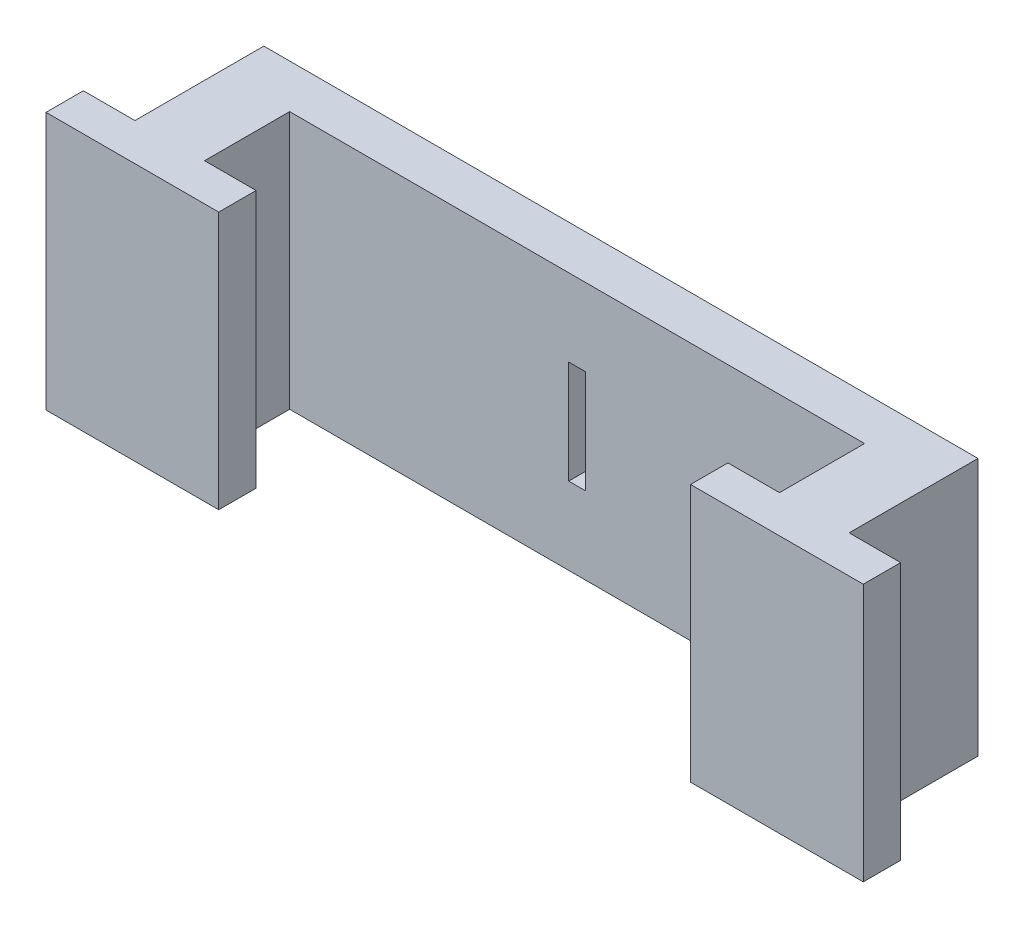
ISO-10303-21;
HEADER;
FILE_DESCRIPTION(('STEP AP214'),'2;1');
FILE_NAME('part.step','',(''),(''),'','','');
FILE_SCHEMA(('AUTOMOTIVE_DESIGN { 1 0 10303 214 1 1 1 1 }'));
ENDSEC;
DATA;
#1=APPLICATION_CONTEXT('core data for automotive mechanical design processes');
#2=APPLICATION_PROTOCOL_DEFINITION('international standard','automotive_design',2000,#1);
#3=PRODUCT_CONTEXT('',#1,'mechanical');
#4=PRODUCT('Part','Part','',(#3));
#5=PRODUCT_RELATED_PRODUCT_CATEGORY('part','',(#4));
#6=PRODUCT_DEFINITION_FORMATION('','',#4);
#7=PRODUCT_DEFINITION_CONTEXT('part definition',#1,'design');
#8=PRODUCT_DEFINITION('design','',#6,#7);
#9=PRODUCT_DEFINITION_SHAPE('','',#8);
#10=(LENGTH_UNIT() NAMED_UNIT(*) SI_UNIT(.MILLI.,.METRE.));
#11=(NAMED_UNIT(*) PLANE_ANGLE_UNIT() SI_UNIT($,.RADIAN.));
#12=(NAMED_UNIT(*) SI_UNIT($,.STERADIAN.) SOLID_ANGLE_UNIT());
#13=UNCERTAINTY_MEASURE_WITH_UNIT(LENGTH_MEASURE(1.E-05),#10,'distance_accuracy_value','');
#14=(GEOMETRIC_REPRESENTATION_CONTEXT(3) GLOBAL_UNCERTAINTY_ASSIGNED_CONTEXT((#13)) GLOBAL_UNIT_ASSIGNED_CONTEXT((#10,
#11,#12)) REPRESENTATION_CONTEXT('',''));
#15=CARTESIAN_POINT('',(0.,0.,0.));
#16=DIRECTION('',(0.,0.,1.));
#17=DIRECTION('',(1.,0.,0.));
#18=AXIS2_PLACEMENT_3D('',#15,#16,#17);
#19=CARTESIAN_POINT('',(0.,0.,0.));
#20=DIRECTION('',(0.,1.,0.));
#21=DIRECTION('',(0.,0.,1.));
#22=AXIS2_PLACEMENT_3D('',#19,#20,#21);
#23=PLANE('',#22);
#24=DIRECTION('',(-1.,0.,0.));
#25=VECTOR('',#24,1.);
#26=CARTESIAN_POINT('',(-1.35,0.,-1.6));
#27=LINE('',#26,#25);
#28=CARTESIAN_POINT('',(-1.35,0.,-1.6));
#29=VERTEX_POINT('',#28);
#30=CARTESIAN_POINT('',(-3.35,0.,-1.6));
#31=VERTEX_POINT('',#30);
#32=EDGE_CURVE('E197',#29,#31,#27,.T.);
#33=ORIENTED_EDGE('',*,*,#32,.F.);
#34=DIRECTION('',(0.,0.,1.));
#35=VECTOR('',#34,1.);
#36=CARTESIAN_POINT('',(-1.35,0.,-6.6));
#37=LINE('',#36,#35);
#38=CARTESIAN_POINT('',(-1.35,0.,-6.6));
#39=VERTEX_POINT('',#38);
#40=EDGE_CURVE('E242',#39,#29,#37,.T.);
#41=ORIENTED_EDGE('',*,*,#40,.F.);
#42=DIRECTION('',(-1.,0.,0.));
#43=VECTOR('',#42,1.);
#44=CARTESIAN_POINT('',(26.35,0.,-6.6));
#45=LINE('',#44,#43);
#46=CARTESIAN_POINT('',(26.35,0.,-6.6));
#47=VERTEX_POINT('',#46);
#48=EDGE_CURVE('E239',#47,#39,#45,.T.);
#49=ORIENTED_EDGE('',*,*,#48,.F.);
#50=DIRECTION('',(0.,0.,-1.));
#51=VECTOR('',#50,1.);
#52=CARTESIAN_POINT('',(26.35,0.,-1.6));
#53=LINE('',#52,#51);
#54=CARTESIAN_POINT('',(26.35,0.,-1.6));
#55=VERTEX_POINT('',#54);
#56=EDGE_CURVE('E236',#55,#47,#53,.T.);
#57=ORIENTED_EDGE('',*,*,#56,.F.);
#58=DIRECTION('',(-1.,0.,0.));
#59=VECTOR('',#58,1.);
#60=CARTESIAN_POINT('',(28.35,0.,-1.6));
#61=LINE('',#60,#59);
#62=CARTESIAN_POINT('',(28.35,0.,-1.6));
#63=VERTEX_POINT('',#62);
#64=EDGE_CURVE('E233',#63,#55,#61,.T.);
#65=ORIENTED_EDGE('',*,*,#64,.F.);
#66=DIRECTION('',(0.,0.,-1.));
#67=VECTOR('',#66,1.);
#68=CARTESIAN_POINT('',(28.35,0.,-0.15));
#69=LINE('',#68,#67);
#70=CARTESIAN_POINT('',(28.35,0.,-0.15));
#71=VERTEX_POINT('',#70);
#72=EDGE_CURVE('E230',#71,#63,#69,.T.);
#73=ORIENTED_EDGE('',*,*,#72,.F.);
#74=DIRECTION('',(1.,0.,0.));
#75=VECTOR('',#74,1.);
#76=CARTESIAN_POINT('',(21.65,0.,-0.15));
#77=LINE('',#76,#75);
#78=CARTESIAN_POINT('',(21.65,0.,-0.15));
#79=VERTEX_POINT('',#78);
#80=EDGE_CURVE('E227',#79,#71,#77,.T.);
#81=ORIENTED_EDGE('',*,*,#80,.F.);
#82=DIRECTION('',(0.,0.,1.));
#83=VECTOR('',#82,1.);
#84=CARTESIAN_POINT('',(21.65,0.,-1.6));
#85=LINE('',#84,#83);
#86=CARTESIAN_POINT('',(21.65,0.,-1.6));
#87=VERTEX_POINT('',#86);
#88=EDGE_CURVE('E224',#87,#79,#85,.T.);
#89=ORIENTED_EDGE('',*,*,#88,.F.);
#90=DIRECTION('',(-1.,0.,0.));
#91=VECTOR('',#90,1.);
#92=CARTESIAN_POINT('',(23.65,0.,-1.6));
#93=LINE('',#92,#91);
#94=CARTESIAN_POINT('',(23.65,0.,-1.6));
#95=VERTEX_POINT('',#94);
#96=EDGE_CURVE('E221',#95,#87,#93,.T.);
#97=ORIENTED_EDGE('',*,*,#96,.F.);
#98=DIRECTION('',(0.,0.,1.));
#99=VECTOR('',#98,1.);
#100=CARTESIAN_POINT('',(23.65,0.,-4.9));
#101=LINE('',#100,#99);
#102=CARTESIAN_POINT('',(23.65,0.,-4.9));
#103=VERTEX_POINT('',#102);
#104=EDGE_CURVE('E218',#103,#95,#101,.T.);
#105=ORIENTED_EDGE('',*,*,#104,.F.);
#106=DIRECTION('',(1.,0.,0.));
#107=VECTOR('',#106,1.);
#108=CARTESIAN_POINT('',(1.35,0.,-4.9));
#109=LINE('',#108,#107);
#110=CARTESIAN_POINT('',(1.35,0.,-4.9));
#111=VERTEX_POINT('',#110);
#112=EDGE_CURVE('E215',#111,#103,#109,.T.);
#113=ORIENTED_EDGE('',*,*,#112,.F.);
#114=DIRECTION('',(0.,0.,-1.));
#115=VECTOR('',#114,1.);
#116=CARTESIAN_POINT('',(1.35,0.,-1.6));
#117=LINE('',#116,#115);
#118=CARTESIAN_POINT('',(1.35,0.,-1.6));
#119=VERTEX_POINT('',#118);
#120=EDGE_CURVE('E212',#119,#111,#117,.T.);
#121=ORIENTED_EDGE('',*,*,#120,.F.);
#122=DIRECTION('',(-1.,0.,0.));
#123=VECTOR('',#122,1.);
#124=CARTESIAN_POINT('',(3.35,0.,-1.6));
#125=LINE('',#124,#123);
#126=CARTESIAN_POINT('',(3.35,0.,-1.6));
#127=VERTEX_POINT('',#126);
#128=EDGE_CURVE('E209',#127,#119,#125,.T.);
#129=ORIENTED_EDGE('',*,*,#128,.F.);
#130=DIRECTION('',(0.,0.,-1.));
#131=VECTOR('',#130,1.);
#132=CARTESIAN_POINT('',(3.35,0.,-0.15));
#133=LINE('',#132,#131);
#134=CARTESIAN_POINT('',(3.35,0.,-0.15));
#135=VERTEX_POINT('',#134);
#136=EDGE_CURVE('E206',#135,#127,#133,.T.);
#137=ORIENTED_EDGE('',*,*,#136,.F.);
#138=DIRECTION('',(1.,0.,0.));
#139=VECTOR('',#138,1.);
#140=CARTESIAN_POINT('',(-3.35,0.,-0.15));
#141=LINE('',#140,#139);
#142=CARTESIAN_POINT('',(-3.35,0.,-0.15));
#143=VERTEX_POINT('',#142);
#144=EDGE_CURVE('E203',#143,#135,#141,.T.);
#145=ORIENTED_EDGE('',*,*,#144,.F.);
#146=DIRECTION('',(0.,0.,1.));
#147=VECTOR('',#146,1.);
#148=CARTESIAN_POINT('',(-3.35,0.,-1.6));
#149=LINE('',#148,#147);
#150=EDGE_CURVE('E199',#31,#143,#149,.T.);
#151=ORIENTED_EDGE('',*,*,#150,.F.);
#152=EDGE_LOOP('',(#33,#41,#49,#57,#65,#73,#81,#89,#97,#105,#113,#121,#129,#137,#145,#151));
#153=FACE_BOUND('',#152,.T.);
#154=ADVANCED_FACE('F33',(#153),#23,.F.);
#155=CARTESIAN_POINT('',(-1.35,0.,-1.6));
#156=DIRECTION('',(0.,0.,-1.));
#157=DIRECTION('',(-1.,0.,0.));
#158=AXIS2_PLACEMENT_3D('',#155,#156,#157);
#159=PLANE('',#158);
#160=DIRECTION('',(-1.,0.,0.));
#161=VECTOR('',#160,1.);
#162=CARTESIAN_POINT('',(-1.35,10.,-1.6));
#163=LINE('',#162,#161);
#164=CARTESIAN_POINT('',(-1.35,10.,-1.6));
#165=VERTEX_POINT('',#164);
#166=CARTESIAN_POINT('',(-3.35,10.,-1.6));
#167=VERTEX_POINT('',#166);
#168=EDGE_CURVE('E194',#165,#167,#163,.T.);
#169=ORIENTED_EDGE('',*,*,#168,.F.);
#170=DIRECTION('',(0.,1.,0.));
#171=VECTOR('',#170,1.);
#172=CARTESIAN_POINT('',(-1.35,0.,-1.6));
#173=LINE('',#172,#171);
#174=EDGE_CURVE('E292',#29,#165,#173,.T.);
#175=ORIENTED_EDGE('',*,*,#174,.F.);
#176=ORIENTED_EDGE('',*,*,#32,.T.);
#177=DIRECTION('',(0.,1.,0.));
#178=VECTOR('',#177,1.);
#179=CARTESIAN_POINT('',(-3.35,0.,-1.6));
#180=LINE('',#179,#178);
#181=EDGE_CURVE('E245',#31,#167,#180,.T.);
#182=ORIENTED_EDGE('',*,*,#181,.T.);
#183=EDGE_LOOP('',(#169,#175,#176,#182));
#184=FACE_BOUND('',#183,.T.);
#185=ADVANCED_FACE('F348',(#184),#159,.T.);
#186=CARTESIAN_POINT('',(-1.35,0.,-6.6));
#187=DIRECTION('',(-1.,0.,0.));
#188=DIRECTION('',(0.,0.,1.));
#189=AXIS2_PLACEMENT_3D('',#186,#187,#188);
#190=PLANE('',#189);
#191=DIRECTION('',(0.,0.,1.));
#192=VECTOR('',#191,1.);
#193=CARTESIAN_POINT('',(-1.35,10.,-6.6));
#194=LINE('',#193,#192);
#195=CARTESIAN_POINT('',(-1.35,10.,-6.6));
#196=VERTEX_POINT('',#195);
#197=EDGE_CURVE('E200',#196,#165,#194,.T.);
#198=ORIENTED_EDGE('',*,*,#197,.F.);
#199=DIRECTION('',(0.,1.,0.));
#200=VECTOR('',#199,1.);
#201=CARTESIAN_POINT('',(-1.35,0.,-6.6));
#202=LINE('',#201,#200);
#203=EDGE_CURVE('E295',#39,#196,#202,.T.);
#204=ORIENTED_EDGE('',*,*,#203,.F.);
#205=ORIENTED_EDGE('',*,*,#40,.T.);
#206=ORIENTED_EDGE('',*,*,#174,.T.);
#207=EDGE_LOOP('',(#198,#204,#205,#206));
#208=FACE_BOUND('',#207,.T.);
#209=ADVANCED_FACE('F353',(#208),#190,.T.);
#210=CARTESIAN_POINT('',(26.35,0.,-6.6));
#211=DIRECTION('',(0.,0.,-1.));
#212=DIRECTION('',(-1.,0.,0.));
#213=AXIS2_PLACEMENT_3D('',#210,#211,#212);
#214=PLANE('',#213);
#215=DIRECTION('',(0.,1.,0.));
#216=VECTOR('',#215,1.);
#217=CARTESIAN_POINT('',(12.175,3.,-6.6));
#218=LINE('',#217,#216);
#219=CARTESIAN_POINT('',(12.175,3.,-6.6));
#220=VERTEX_POINT('',#219);
#221=CARTESIAN_POINT('',(12.175,7.,-6.6));
#222=VERTEX_POINT('',#221);
#223=EDGE_CURVE('E47',#220,#222,#218,.T.);
#224=ORIENTED_EDGE('',*,*,#223,.F.);
#225=DIRECTION('',(-1.,0.,0.));
#226=VECTOR('',#225,1.);
#227=CARTESIAN_POINT('',(12.175,3.,-6.6));
#228=LINE('',#227,#226);
#229=CARTESIAN_POINT('',(12.825,3.,-6.6));
#230=VERTEX_POINT('',#229);
#231=EDGE_CURVE('E187',#230,#220,#228,.T.);
#232=ORIENTED_EDGE('',*,*,#231,.F.);
#233=DIRECTION('',(0.,-1.,0.));
#234=VECTOR('',#233,1.);
#235=CARTESIAN_POINT('',(12.825,3.,-6.6));
#236=LINE('',#235,#234);
#237=CARTESIAN_POINT('',(12.825,7.,-6.6));
#238=VERTEX_POINT('',#237);
#239=EDGE_CURVE('E171',#238,#230,#236,.T.);
#240=ORIENTED_EDGE('',*,*,#239,.F.);
#241=DIRECTION('',(1.,0.,0.));
#242=VECTOR('',#241,1.);
#243=CARTESIAN_POINT('',(12.175,7.,-6.6));
#244=LINE('',#243,#242);
#245=EDGE_CURVE('E180',#222,#238,#244,.T.);
#246=ORIENTED_EDGE('',*,*,#245,.F.);
#247=EDGE_LOOP('',(#224,#232,#240,#246));
#248=FACE_BOUND('',#247,.T.);
#249=DIRECTION('',(-1.,0.,0.));
#250=VECTOR('',#249,1.);
#251=CARTESIAN_POINT('',(26.35,10.,-6.6));
#252=LINE('',#251,#250);
#253=CARTESIAN_POINT('',(26.35,10.,-6.6));
#254=VERTEX_POINT('',#253);
#255=EDGE_CURVE('E287',#254,#196,#252,.T.);
#256=ORIENTED_EDGE('',*,*,#255,.F.);
#257=DIRECTION('',(0.,1.,0.));
#258=VECTOR('',#257,1.);
#259=CARTESIAN_POINT('',(26.35,0.,-6.6));
#260=LINE('',#259,#258);
#261=EDGE_CURVE('E297',#47,#254,#260,.T.);
#262=ORIENTED_EDGE('',*,*,#261,.F.);
#263=ORIENTED_EDGE('',*,*,#48,.T.);
#264=ORIENTED_EDGE('',*,*,#203,.T.);
#265=EDGE_LOOP('',(#256,#262,#263,#264));
#266=FACE_BOUND('',#265,.T.);
#267=ADVANCED_FACE('F184',(#248,#266),#214,.T.);
#268=CARTESIAN_POINT('',(26.35,0.,-1.6));
#269=DIRECTION('',(1.,0.,0.));
#270=DIRECTION('',(0.,0.,-1.));
#271=AXIS2_PLACEMENT_3D('',#268,#269,#270);
#272=PLANE('',#271);
#273=DIRECTION('',(0.,0.,-1.));
#274=VECTOR('',#273,1.);
#275=CARTESIAN_POINT('',(26.35,10.,-1.6));
#276=LINE('',#275,#274);
#277=CARTESIAN_POINT('',(26.35,10.,-1.6));
#278=VERTEX_POINT('',#277);
#279=EDGE_CURVE('E284',#278,#254,#276,.T.);
#280=ORIENTED_EDGE('',*,*,#279,.F.);
#281=DIRECTION('',(0.,1.,0.));
#282=VECTOR('',#281,1.);
#283=CARTESIAN_POINT('',(26.35,0.,-1.6));
#284=LINE('',#283,#282);
#285=EDGE_CURVE('E299',#55,#278,#284,.T.);
#286=ORIENTED_EDGE('',*,*,#285,.F.);
#287=ORIENTED_EDGE('',*,*,#56,.T.);
#288=ORIENTED_EDGE('',*,*,#261,.T.);
#289=EDGE_LOOP('',(#280,#286,#287,#288));
#290=FACE_BOUND('',#289,.T.);
#291=ADVANCED_FACE('F373',(#290),#272,.T.);
#292=CARTESIAN_POINT('',(28.35,0.,-1.6));
#293=DIRECTION('',(0.,0.,-1.));
#294=DIRECTION('',(-1.,0.,0.));
#295=AXIS2_PLACEMENT_3D('',#292,#293,#294);
#296=PLANE('',#295);
#297=DIRECTION('',(-1.,0.,0.));
#298=VECTOR('',#297,1.);
#299=CARTESIAN_POINT('',(28.35,10.,-1.6));
#300=LINE('',#299,#298);
#301=CARTESIAN_POINT('',(28.35,10.,-1.6));
#302=VERTEX_POINT('',#301);
#303=EDGE_CURVE('E281',#302,#278,#300,.T.);
#304=ORIENTED_EDGE('',*,*,#303,.F.);
#305=DIRECTION('',(0.,1.,0.));
#306=VECTOR('',#305,1.);
#307=CARTESIAN_POINT('',(28.35,0.,-1.6));
#308=LINE('',#307,#306);
#309=EDGE_CURVE('E301',#63,#302,#308,.T.);
#310=ORIENTED_EDGE('',*,*,#309,.F.);
#311=ORIENTED_EDGE('',*,*,#64,.T.);
#312=ORIENTED_EDGE('',*,*,#285,.T.);
#313=EDGE_LOOP('',(#304,#310,#311,#312));
#314=FACE_BOUND('',#313,.T.);
#315=ADVANCED_FACE('F376',(#314),#296,.T.);
#316=CARTESIAN_POINT('',(28.35,0.,-0.15));
#317=DIRECTION('',(1.,0.,0.));
#318=DIRECTION('',(0.,0.,-1.));
#319=AXIS2_PLACEMENT_3D('',#316,#317,#318);
#320=PLANE('',#319);
#321=DIRECTION('',(0.,0.,-1.));
#322=VECTOR('',#321,1.);
#323=CARTESIAN_POINT('',(28.35,10.,-0.15));
#324=LINE('',#323,#322);
#325=CARTESIAN_POINT('',(28.35,10.,-0.15));
#326=VERTEX_POINT('',#325);
#327=EDGE_CURVE('E278',#326,#302,#324,.T.);
#328=ORIENTED_EDGE('',*,*,#327,.F.);
#329=DIRECTION('',(0.,1.,0.));
#330=VECTOR('',#329,1.);
#331=CARTESIAN_POINT('',(28.35,0.,-0.15));
#332=LINE('',#331,#330);
#333=EDGE_CURVE('E303',#71,#326,#332,.T.);
#334=ORIENTED_EDGE('',*,*,#333,.F.);
#335=ORIENTED_EDGE('',*,*,#72,.T.);
#336=ORIENTED_EDGE('',*,*,#309,.T.);
#337=EDGE_LOOP('',(#328,#334,#335,#336));
#338=FACE_BOUND('',#337,.T.);
#339=ADVANCED_FACE('F379',(#338),#320,.T.);
#340=CARTESIAN_POINT('',(21.65,0.,-0.15));
#341=DIRECTION('',(0.,0.,1.));
#342=DIRECTION('',(1.,0.,0.));
#343=AXIS2_PLACEMENT_3D('',#340,#341,#342);
#344=PLANE('',#343);
#345=DIRECTION('',(1.,0.,0.));
#346=VECTOR('',#345,1.);
#347=CARTESIAN_POINT('',(21.65,10.,-0.15));
#348=LINE('',#347,#346);
#349=CARTESIAN_POINT('',(21.65,10.,-0.15));
#350=VERTEX_POINT('',#349);
#351=EDGE_CURVE('E275',#350,#326,#348,.T.);
#352=ORIENTED_EDGE('',*,*,#351,.F.);
#353=DIRECTION('',(0.,1.,0.));
#354=VECTOR('',#353,1.);
#355=CARTESIAN_POINT('',(21.65,0.,-0.15));
#356=LINE('',#355,#354);
#357=EDGE_CURVE('E305',#79,#350,#356,.T.);
#358=ORIENTED_EDGE('',*,*,#357,.F.);
#359=ORIENTED_EDGE('',*,*,#80,.T.);
#360=ORIENTED_EDGE('',*,*,#333,.T.);
#361=EDGE_LOOP('',(#352,#358,#359,#360));
#362=FACE_BOUND('',#361,.T.);
#363=ADVANCED_FACE('F385',(#362),#344,.T.);
#364=CARTESIAN_POINT('',(21.65,0.,-1.6));
#365=DIRECTION('',(-1.,0.,0.));
#366=DIRECTION('',(0.,0.,1.));
#367=AXIS2_PLACEMENT_3D('',#364,#365,#366);
#368=PLANE('',#367);
#369=DIRECTION('',(0.,0.,1.));
#370=VECTOR('',#369,1.);
#371=CARTESIAN_POINT('',(21.65,10.,-1.6));
#372=LINE('',#371,#370);
#373=CARTESIAN_POINT('',(21.65,10.,-1.6));
#374=VERTEX_POINT('',#373);
#375=EDGE_CURVE('E272',#374,#350,#372,.T.);
#376=ORIENTED_EDGE('',*,*,#375,.F.);
#377=DIRECTION('',(0.,1.,0.));
#378=VECTOR('',#377,1.);
#379=CARTESIAN_POINT('',(21.65,0.,-1.6));
#380=LINE('',#379,#378);
#381=EDGE_CURVE('E307',#87,#374,#380,.T.);
#382=ORIENTED_EDGE('',*,*,#381,.F.);
#383=ORIENTED_EDGE('',*,*,#88,.T.);
#384=ORIENTED_EDGE('',*,*,#357,.T.);
#385=EDGE_LOOP('',(#376,#382,#383,#384));
#386=FACE_BOUND('',#385,.T.);
#387=ADVANCED_FACE('F388',(#386),#368,.T.);
#388=CARTESIAN_POINT('',(23.65,0.,-1.6));
#389=DIRECTION('',(0.,0.,-1.));
#390=DIRECTION('',(-1.,0.,0.));
#391=AXIS2_PLACEMENT_3D('',#388,#389,#390);
#392=PLANE('',#391);
#393=DIRECTION('',(-1.,0.,0.));
#394=VECTOR('',#393,1.);
#395=CARTESIAN_POINT('',(23.65,10.,-1.6));
#396=LINE('',#395,#394);
#397=CARTESIAN_POINT('',(23.65,10.,-1.6));
#398=VERTEX_POINT('',#397);
#399=EDGE_CURVE('E269',#398,#374,#396,.T.);
#400=ORIENTED_EDGE('',*,*,#399,.F.);
#401=DIRECTION('',(0.,1.,0.));
#402=VECTOR('',#401,1.);
#403=CARTESIAN_POINT('',(23.65,0.,-1.6));
#404=LINE('',#403,#402);
#405=EDGE_CURVE('E309',#95,#398,#404,.T.);
#406=ORIENTED_EDGE('',*,*,#405,.F.);
#407=ORIENTED_EDGE('',*,*,#96,.T.);
#408=ORIENTED_EDGE('',*,*,#381,.T.);
#409=EDGE_LOOP('',(#400,#406,#407,#408));
#410=FACE_BOUND('',#409,.T.);
#411=ADVANCED_FACE('F391',(#410),#392,.T.);
#412=CARTESIAN_POINT('',(23.65,0.,-4.9));
#413=DIRECTION('',(-1.,0.,0.));
#414=DIRECTION('',(0.,0.,1.));
#415=AXIS2_PLACEMENT_3D('',#412,#413,#414);
#416=PLANE('',#415);
#417=DIRECTION('',(0.,0.,1.));
#418=VECTOR('',#417,1.);
#419=CARTESIAN_POINT('',(23.65,10.,-4.9));
#420=LINE('',#419,#418);
#421=CARTESIAN_POINT('',(23.65,10.,-4.9));
#422=VERTEX_POINT('',#421);
#423=EDGE_CURVE('E266',#422,#398,#420,.T.);
#424=ORIENTED_EDGE('',*,*,#423,.F.);
#425=DIRECTION('',(0.,1.,0.));
#426=VECTOR('',#425,1.);
#427=CARTESIAN_POINT('',(23.65,0.,-4.9));
#428=LINE('',#427,#426);
#429=EDGE_CURVE('E311',#103,#422,#428,.T.);
#430=ORIENTED_EDGE('',*,*,#429,.F.);
#431=ORIENTED_EDGE('',*,*,#104,.T.);
#432=ORIENTED_EDGE('',*,*,#405,.T.);
#433=EDGE_LOOP('',(#424,#430,#431,#432));
#434=FACE_BOUND('',#433,.T.);
#435=ADVANCED_FACE('F397',(#434),#416,.T.);
#436=CARTESIAN_POINT('',(1.35,0.,-4.9));
#437=DIRECTION('',(0.,0.,1.));
#438=DIRECTION('',(1.,0.,0.));
#439=AXIS2_PLACEMENT_3D('',#436,#437,#438);
#440=PLANE('',#439);
#441=DIRECTION('',(0.,-1.,0.));
#442=VECTOR('',#441,1.);
#443=CARTESIAN_POINT('',(12.175,0.,-4.9));
#444=LINE('',#443,#442);
#445=CARTESIAN_POINT('',(12.175,7.,-4.9));
#446=VERTEX_POINT('',#445);
#447=CARTESIAN_POINT('',(12.175,3.,-4.9));
#448=VERTEX_POINT('',#447);
#449=EDGE_CURVE('E11',#446,#448,#444,.T.);
#450=ORIENTED_EDGE('',*,*,#449,.F.);
#451=DIRECTION('',(-1.,0.,0.));
#452=VECTOR('',#451,1.);
#453=CARTESIAN_POINT('',(1.35,7.,-4.9));
#454=LINE('',#453,#452);
#455=CARTESIAN_POINT('',(12.825,7.,-4.9));
#456=VERTEX_POINT('',#455);
#457=EDGE_CURVE('E294',#456,#446,#454,.T.);
#458=ORIENTED_EDGE('',*,*,#457,.F.);
#459=DIRECTION('',(0.,1.,0.));
#460=VECTOR('',#459,1.);
#461=CARTESIAN_POINT('',(12.825,0.,-4.9));
#462=LINE('',#461,#460);
#463=CARTESIAN_POINT('',(12.825,3.,-4.9));
#464=VERTEX_POINT('',#463);
#465=EDGE_CURVE('E174',#464,#456,#462,.T.);
#466=ORIENTED_EDGE('',*,*,#465,.F.);
#467=DIRECTION('',(1.,0.,0.));
#468=VECTOR('',#467,1.);
#469=CARTESIAN_POINT('',(1.35,3.,-4.9));
#470=LINE('',#469,#468);
#471=EDGE_CURVE('E40',#448,#464,#470,.T.);
#472=ORIENTED_EDGE('',*,*,#471,.F.);
#473=EDGE_LOOP('',(#450,#458,#466,#472));
#474=FACE_BOUND('',#473,.T.);
#475=DIRECTION('',(1.,0.,0.));
#476=VECTOR('',#475,1.);
#477=CARTESIAN_POINT('',(1.35,10.,-4.9));
#478=LINE('',#477,#476);
#479=CARTESIAN_POINT('',(1.35,10.,-4.9));
#480=VERTEX_POINT('',#479);
#481=EDGE_CURVE('E263',#480,#422,#478,.T.);
#482=ORIENTED_EDGE('',*,*,#481,.F.);
#483=DIRECTION('',(0.,1.,0.));
#484=VECTOR('',#483,1.);
#485=CARTESIAN_POINT('',(1.35,0.,-4.9));
#486=LINE('',#485,#484);
#487=EDGE_CURVE('E313',#111,#480,#486,.T.);
#488=ORIENTED_EDGE('',*,*,#487,.F.);
#489=ORIENTED_EDGE('',*,*,#112,.T.);
#490=ORIENTED_EDGE('',*,*,#429,.T.);
#491=EDGE_LOOP('',(#482,#488,#489,#490));
#492=FACE_BOUND('',#491,.T.);
#493=ADVANCED_FACE('F332',(#474,#492),#440,.T.);
#494=CARTESIAN_POINT('',(1.35,0.,-1.6));
#495=DIRECTION('',(1.,0.,0.));
#496=DIRECTION('',(0.,0.,-1.));
#497=AXIS2_PLACEMENT_3D('',#494,#495,#496);
#498=PLANE('',#497);
#499=DIRECTION('',(0.,0.,-1.));
#500=VECTOR('',#499,1.);
#501=CARTESIAN_POINT('',(1.35,10.,-1.6));
#502=LINE('',#501,#500);
#503=CARTESIAN_POINT('',(1.35,10.,-1.6));
#504=VERTEX_POINT('',#503);
#505=EDGE_CURVE('E260',#504,#480,#502,.T.);
#506=ORIENTED_EDGE('',*,*,#505,.F.);
#507=DIRECTION('',(0.,1.,0.));
#508=VECTOR('',#507,1.);
#509=CARTESIAN_POINT('',(1.35,0.,-1.6));
#510=LINE('',#509,#508);
#511=EDGE_CURVE('E315',#119,#504,#510,.T.);
#512=ORIENTED_EDGE('',*,*,#511,.F.);
#513=ORIENTED_EDGE('',*,*,#120,.T.);
#514=ORIENTED_EDGE('',*,*,#487,.T.);
#515=EDGE_LOOP('',(#506,#512,#513,#514));
#516=FACE_BOUND('',#515,.T.);
#517=ADVANCED_FACE('F401',(#516),#498,.T.);
#518=CARTESIAN_POINT('',(3.35,0.,-1.6));
#519=DIRECTION('',(0.,0.,-1.));
#520=DIRECTION('',(-1.,0.,0.));
#521=AXIS2_PLACEMENT_3D('',#518,#519,#520);
#522=PLANE('',#521);
#523=DIRECTION('',(-1.,0.,0.));
#524=VECTOR('',#523,1.);
#525=CARTESIAN_POINT('',(3.35,10.,-1.6));
#526=LINE('',#525,#524);
#527=CARTESIAN_POINT('',(3.35,10.,-1.6));
#528=VERTEX_POINT('',#527);
#529=EDGE_CURVE('E257',#528,#504,#526,.T.);
#530=ORIENTED_EDGE('',*,*,#529,.F.);
#531=DIRECTION('',(0.,1.,0.));
#532=VECTOR('',#531,1.);
#533=CARTESIAN_POINT('',(3.35,0.,-1.6));
#534=LINE('',#533,#532);
#535=EDGE_CURVE('E317',#127,#528,#534,.T.);
#536=ORIENTED_EDGE('',*,*,#535,.F.);
#537=ORIENTED_EDGE('',*,*,#128,.T.);
#538=ORIENTED_EDGE('',*,*,#511,.T.);
#539=EDGE_LOOP('',(#530,#536,#537,#538));
#540=FACE_BOUND('',#539,.T.);
#541=ADVANCED_FACE('F406',(#540),#522,.T.);
#542=CARTESIAN_POINT('',(3.35,0.,-0.15));
#543=DIRECTION('',(1.,0.,0.));
#544=DIRECTION('',(0.,0.,-1.));
#545=AXIS2_PLACEMENT_3D('',#542,#543,#544);
#546=PLANE('',#545);
#547=DIRECTION('',(0.,0.,-1.));
#548=VECTOR('',#547,1.);
#549=CARTESIAN_POINT('',(3.35,10.,-0.15));
#550=LINE('',#549,#548);
#551=CARTESIAN_POINT('',(3.35,10.,-0.15));
#552=VERTEX_POINT('',#551);
#553=EDGE_CURVE('E254',#552,#528,#550,.T.);
#554=ORIENTED_EDGE('',*,*,#553,.F.);
#555=DIRECTION('',(0.,1.,0.));
#556=VECTOR('',#555,1.);
#557=CARTESIAN_POINT('',(3.35,0.,-0.15));
#558=LINE('',#557,#556);
#559=EDGE_CURVE('E319',#135,#552,#558,.T.);
#560=ORIENTED_EDGE('',*,*,#559,.F.);
#561=ORIENTED_EDGE('',*,*,#136,.T.);
#562=ORIENTED_EDGE('',*,*,#535,.T.);
#563=EDGE_LOOP('',(#554,#560,#561,#562));
#564=FACE_BOUND('',#563,.T.);
#565=ADVANCED_FACE('F409',(#564),#546,.T.);
#566=CARTESIAN_POINT('',(-3.35,0.,-0.15));
#567=DIRECTION('',(0.,0.,1.));
#568=DIRECTION('',(1.,0.,0.));
#569=AXIS2_PLACEMENT_3D('',#566,#567,#568);
#570=PLANE('',#569);
#571=DIRECTION('',(1.,0.,0.));
#572=VECTOR('',#571,1.);
#573=CARTESIAN_POINT('',(-3.35,10.,-0.15));
#574=LINE('',#573,#572);
#575=CARTESIAN_POINT('',(-3.35,10.,-0.15));
#576=VERTEX_POINT('',#575);
#577=EDGE_CURVE('E251',#576,#552,#574,.T.);
#578=ORIENTED_EDGE('',*,*,#577,.F.);
#579=DIRECTION('',(0.,1.,0.));
#580=VECTOR('',#579,1.);
#581=CARTESIAN_POINT('',(-3.35,0.,-0.15));
#582=LINE('',#581,#580);
#583=EDGE_CURVE('E321',#143,#576,#582,.T.);
#584=ORIENTED_EDGE('',*,*,#583,.F.);
#585=ORIENTED_EDGE('',*,*,#144,.T.);
#586=ORIENTED_EDGE('',*,*,#559,.T.);
#587=EDGE_LOOP('',(#578,#584,#585,#586));
#588=FACE_BOUND('',#587,.T.);
#589=ADVANCED_FACE('F411',(#588),#570,.T.);
#590=CARTESIAN_POINT('',(-3.35,0.,-1.6));
#591=DIRECTION('',(-1.,0.,0.));
#592=DIRECTION('',(0.,0.,1.));
#593=AXIS2_PLACEMENT_3D('',#590,#591,#592);
#594=PLANE('',#593);
#595=DIRECTION('',(0.,0.,1.));
#596=VECTOR('',#595,1.);
#597=CARTESIAN_POINT('',(-3.35,10.,-1.6));
#598=LINE('',#597,#596);
#599=EDGE_CURVE('E248',#167,#576,#598,.T.);
#600=ORIENTED_EDGE('',*,*,#599,.F.);
#601=ORIENTED_EDGE('',*,*,#181,.F.);
#602=ORIENTED_EDGE('',*,*,#150,.T.);
#603=ORIENTED_EDGE('',*,*,#583,.T.);
#604=EDGE_LOOP('',(#600,#601,#602,#603));
#605=FACE_BOUND('',#604,.T.);
#606=ADVANCED_FACE('F343',(#605),#594,.T.);
#607=CARTESIAN_POINT('',(0.,10.,0.));
#608=DIRECTION('',(0.,1.,0.));
#609=DIRECTION('',(0.,0.,1.));
#610=AXIS2_PLACEMENT_3D('',#607,#608,#609);
#611=PLANE('',#610);
#612=ORIENTED_EDGE('',*,*,#197,.T.);
#613=ORIENTED_EDGE('',*,*,#168,.T.);
#614=ORIENTED_EDGE('',*,*,#599,.T.);
#615=ORIENTED_EDGE('',*,*,#577,.T.);
#616=ORIENTED_EDGE('',*,*,#553,.T.);
#617=ORIENTED_EDGE('',*,*,#529,.T.);
#618=ORIENTED_EDGE('',*,*,#505,.T.);
#619=ORIENTED_EDGE('',*,*,#481,.T.);
#620=ORIENTED_EDGE('',*,*,#423,.T.);
#621=ORIENTED_EDGE('',*,*,#399,.T.);
#622=ORIENTED_EDGE('',*,*,#375,.T.);
#623=ORIENTED_EDGE('',*,*,#351,.T.);
#624=ORIENTED_EDGE('',*,*,#327,.T.);
#625=ORIENTED_EDGE('',*,*,#303,.T.);
#626=ORIENTED_EDGE('',*,*,#279,.T.);
#627=ORIENTED_EDGE('',*,*,#255,.T.);
#628=EDGE_LOOP('',(#612,#613,#614,#615,#616,#617,#618,#619,#620,#621,#622,#623,#624,#625,#626,#627));
#629=FACE_BOUND('',#628,.T.);
#630=ADVANCED_FACE('F336',(#629),#611,.T.);
#631=CARTESIAN_POINT('',(12.175,3.,-0.15));
#632=DIRECTION('',(-1.,0.,0.));
#633=DIRECTION('',(0.,0.,1.));
#634=AXIS2_PLACEMENT_3D('',#631,#632,#633);
#635=PLANE('',#634);
#636=ORIENTED_EDGE('',*,*,#449,.T.);
#637=DIRECTION('',(0.,0.,-1.));
#638=VECTOR('',#637,1.);
#639=CARTESIAN_POINT('',(12.175,3.,-0.15));
#640=LINE('',#639,#638);
#641=EDGE_CURVE('E192',#448,#220,#640,.T.);
#642=ORIENTED_EDGE('',*,*,#641,.T.);
#643=ORIENTED_EDGE('',*,*,#223,.T.);
#644=DIRECTION('',(0.,0.,-1.));
#645=VECTOR('',#644,1.);
#646=CARTESIAN_POINT('',(12.175,7.,-0.15));
#647=LINE('',#646,#645);
#648=EDGE_CURVE('E177',#446,#222,#647,.T.);
#649=ORIENTED_EDGE('',*,*,#648,.F.);
#650=EDGE_LOOP('',(#636,#642,#643,#649));
#651=FACE_BOUND('',#650,.T.);
#652=ADVANCED_FACE('F334',(#651),#635,.F.);
#653=CARTESIAN_POINT('',(12.175,3.,-0.15));
#654=DIRECTION('',(0.,-1.,0.));
#655=DIRECTION('',(0.,0.,-1.));
#656=AXIS2_PLACEMENT_3D('',#653,#654,#655);
#657=PLANE('',#656);
#658=ORIENTED_EDGE('',*,*,#471,.T.);
#659=DIRECTION('',(0.,0.,-1.));
#660=VECTOR('',#659,1.);
#661=CARTESIAN_POINT('',(12.825,3.,-0.15));
#662=LINE('',#661,#660);
#663=EDGE_CURVE('E176',#464,#230,#662,.T.);
#664=ORIENTED_EDGE('',*,*,#663,.T.);
#665=ORIENTED_EDGE('',*,*,#231,.T.);
#666=ORIENTED_EDGE('',*,*,#641,.F.);
#667=EDGE_LOOP('',(#658,#664,#665,#666));
#668=FACE_BOUND('',#667,.T.);
#669=ADVANCED_FACE('F329',(#668),#657,.F.);
#670=CARTESIAN_POINT('',(12.825,3.,-0.15));
#671=DIRECTION('',(1.,0.,0.));
#672=DIRECTION('',(0.,0.,-1.));
#673=AXIS2_PLACEMENT_3D('',#670,#671,#672);
#674=PLANE('',#673);
#675=ORIENTED_EDGE('',*,*,#465,.T.);
#676=DIRECTION('',(0.,0.,-1.));
#677=VECTOR('',#676,1.);
#678=CARTESIAN_POINT('',(12.825,7.,-0.15));
#679=LINE('',#678,#677);
#680=EDGE_CURVE('E55',#456,#238,#679,.T.);
#681=ORIENTED_EDGE('',*,*,#680,.T.);
#682=ORIENTED_EDGE('',*,*,#239,.T.);
#683=ORIENTED_EDGE('',*,*,#663,.F.);
#684=EDGE_LOOP('',(#675,#681,#682,#683));
#685=FACE_BOUND('',#684,.T.);
#686=ADVANCED_FACE('F168',(#685),#674,.F.);
#687=CARTESIAN_POINT('',(12.175,7.,-0.15));
#688=DIRECTION('',(0.,1.,0.));
#689=DIRECTION('',(0.,0.,1.));
#690=AXIS2_PLACEMENT_3D('',#687,#688,#689);
#691=PLANE('',#690);
#692=ORIENTED_EDGE('',*,*,#457,.T.);
#693=ORIENTED_EDGE('',*,*,#648,.T.);
#694=ORIENTED_EDGE('',*,*,#245,.T.);
#695=ORIENTED_EDGE('',*,*,#680,.F.);
#696=EDGE_LOOP('',(#692,#693,#694,#695));
#697=FACE_BOUND('',#696,.T.);
#698=ADVANCED_FACE('F181',(#697),#691,.F.);
#699=CLOSED_SHELL('',(#154,#185,#209,#267,#291,#315,#339,#363,#387,#411,#435,#493,#517,#541,
#565,#589,#606,#630,#652,#669,#686,#698));
#700=MANIFOLD_SOLID_BREP('B2',#699);
#701=ADVANCED_BREP_SHAPE_REPRESENTATION('',(#18,#700),#14);
#702=SHAPE_DEFINITION_REPRESENTATION(#9,#701);
ENDSEC;
END-ISO-10303-21;
